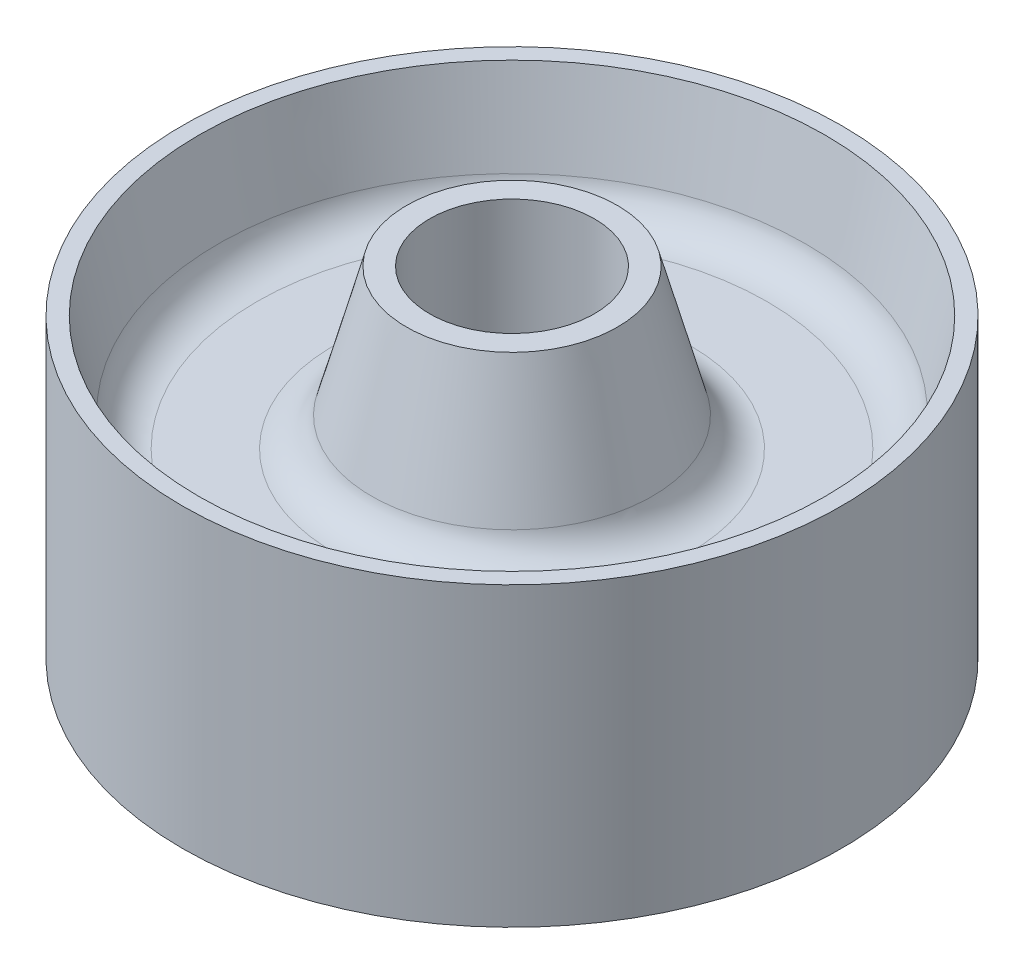
ISO-10303-21;
HEADER;
FILE_DESCRIPTION(('STEP AP214'),'2;1');
FILE_NAME('part.step','',(''),(''),'','','');
FILE_SCHEMA(('AUTOMOTIVE_DESIGN { 1 0 10303 214 1 1 1 1 }'));
ENDSEC;
DATA;
#1=APPLICATION_CONTEXT('core data for automotive mechanical design processes');
#2=APPLICATION_PROTOCOL_DEFINITION('international standard','automotive_design',2000,#1);
#3=PRODUCT_CONTEXT('',#1,'mechanical');
#4=PRODUCT('Part','Part','',(#3));
#5=PRODUCT_RELATED_PRODUCT_CATEGORY('part','',(#4));
#6=PRODUCT_DEFINITION_FORMATION('','',#4);
#7=PRODUCT_DEFINITION_CONTEXT('part definition',#1,'design');
#8=PRODUCT_DEFINITION('design','',#6,#7);
#9=PRODUCT_DEFINITION_SHAPE('','',#8);
#10=(LENGTH_UNIT() NAMED_UNIT(*) SI_UNIT(.MILLI.,.METRE.));
#11=(NAMED_UNIT(*) PLANE_ANGLE_UNIT() SI_UNIT($,.RADIAN.));
#12=(NAMED_UNIT(*) SI_UNIT($,.STERADIAN.) SOLID_ANGLE_UNIT());
#13=UNCERTAINTY_MEASURE_WITH_UNIT(LENGTH_MEASURE(1.E-05),#10,'distance_accuracy_value','');
#14=(GEOMETRIC_REPRESENTATION_CONTEXT(3) GLOBAL_UNCERTAINTY_ASSIGNED_CONTEXT((#13)) GLOBAL_UNIT_ASSIGNED_CONTEXT((#10,
#11,#12)) REPRESENTATION_CONTEXT('',''));
#15=CARTESIAN_POINT('',(0.,0.,0.));
#16=DIRECTION('',(0.,0.,1.));
#17=DIRECTION('',(1.,0.,0.));
#18=AXIS2_PLACEMENT_3D('',#15,#16,#17);
#19=CARTESIAN_POINT('',(0.,0.,0.));
#20=DIRECTION('',(0.,-1.,0.));
#21=DIRECTION('',(0.,0.,-1.));
#22=AXIS2_PLACEMENT_3D('',#19,#20,#21);
#23=CYLINDRICAL_SURFACE('',#22,12.5);
#24=CARTESIAN_POINT('',(0.,0.,0.));
#25=DIRECTION('',(0.,-1.,0.));
#26=DIRECTION('',(0.,0.,-1.));
#27=AXIS2_PLACEMENT_3D('',#24,#25,#26);
#28=CIRCLE('',#27,12.5);
#29=CARTESIAN_POINT('',(0.,0.,-12.5));
#30=VERTEX_POINT('',#29);
#31=EDGE_CURVE('E85',#30,#30,#28,.T.);
#32=ORIENTED_EDGE('',*,*,#31,.T.);
#33=EDGE_LOOP('',(#32));
#34=FACE_BOUND('',#33,.T.);
#35=CARTESIAN_POINT('',(0.,58.,0.));
#36=DIRECTION('',(0.,-1.,0.));
#37=DIRECTION('',(0.,0.,-1.));
#38=AXIS2_PLACEMENT_3D('',#35,#36,#37);
#39=CIRCLE('',#38,12.5);
#40=CARTESIAN_POINT('',(0.,58.,-12.5));
#41=VERTEX_POINT('',#40);
#42=EDGE_CURVE('E10',#41,#41,#39,.T.);
#43=ORIENTED_EDGE('',*,*,#42,.F.);
#44=EDGE_LOOP('',(#43));
#45=FACE_BOUND('',#44,.T.);
#46=ADVANCED_FACE('F33',(#34,#45),#23,.F.);
#47=CARTESIAN_POINT('',(16.,58.,0.));
#48=DIRECTION('',(0.,1.,0.));
#49=DIRECTION('',(0.,0.,1.));
#50=AXIS2_PLACEMENT_3D('',#47,#48,#49);
#51=PLANE('',#50);
#52=ORIENTED_EDGE('',*,*,#42,.T.);
#53=EDGE_LOOP('',(#52));
#54=FACE_BOUND('',#53,.T.);
#55=CARTESIAN_POINT('',(0.,58.,0.));
#56=DIRECTION('',(0.,-1.,0.));
#57=DIRECTION('',(0.,0.,-1.));
#58=AXIS2_PLACEMENT_3D('',#55,#56,#57);
#59=CIRCLE('',#58,16.);
#60=CARTESIAN_POINT('',(0.,58.,-16.));
#61=VERTEX_POINT('',#60);
#62=EDGE_CURVE('E39',#61,#61,#59,.T.);
#63=ORIENTED_EDGE('',*,*,#62,.F.);
#64=EDGE_LOOP('',(#63));
#65=FACE_BOUND('',#64,.T.);
#66=ADVANCED_FACE('F103',(#54,#65),#51,.T.);
#67=CARTESIAN_POINT('',(0.,38.4315071456301,0.));
#68=DIRECTION('',(0.,-1.,0.));
#69=DIRECTION('',(0.,0.,-1.));
#70=AXIS2_PLACEMENT_3D('',#67,#68,#69);
#71=CONICAL_SURFACE('',#70,21.2998001480585,0.264488382549233);
#72=ORIENTED_EDGE('',*,*,#62,.T.);
#73=EDGE_LOOP('',(#72));
#74=FACE_BOUND('',#73,.T.);
#75=CARTESIAN_POINT('',(0.,38.4315071456301,0.));
#76=DIRECTION('',(0.,-1.,0.));
#77=DIRECTION('',(0.,0.,-1.));
#78=AXIS2_PLACEMENT_3D('',#75,#76,#77);
#79=CIRCLE('',#78,21.2998001480585);
#80=CARTESIAN_POINT('',(0.,38.4315071456301,-21.2998001480585));
#81=VERTEX_POINT('',#80);
#82=EDGE_CURVE('E43',#81,#81,#79,.T.);
#83=ORIENTED_EDGE('',*,*,#82,.F.);
#84=EDGE_LOOP('',(#83));
#85=FACE_BOUND('',#84,.T.);
#86=ADVANCED_FACE('F107',(#74,#85),#71,.T.);
#87=CARTESIAN_POINT('',(0.,40.,0.));
#88=DIRECTION('',(0.,-1.,0.));
#89=DIRECTION('',(0.,0.,-1.));
#90=AXIS2_PLACEMENT_3D('',#87,#88,#89);
#91=TOROIDAL_SURFACE('',#90,27.0911583795782,6.);
#92=ORIENTED_EDGE('',*,*,#82,.T.);
#93=EDGE_LOOP('',(#92));
#94=FACE_BOUND('',#93,.T.);
#95=CARTESIAN_POINT('',(0.,34.,0.));
#96=DIRECTION('',(0.,-1.,0.));
#97=DIRECTION('',(0.,0.,-1.));
#98=AXIS2_PLACEMENT_3D('',#95,#96,#97);
#99=CIRCLE('',#98,27.0911583795782);
#100=CARTESIAN_POINT('',(0.,34.,-27.0911583795782));
#101=VERTEX_POINT('',#100);
#102=EDGE_CURVE('E47',#101,#101,#99,.T.);
#103=ORIENTED_EDGE('',*,*,#102,.F.);
#104=EDGE_LOOP('',(#103));
#105=FACE_BOUND('',#104,.T.);
#106=ADVANCED_FACE('F111',(#94,#105),#91,.F.);
#107=CARTESIAN_POINT('',(38.7166892327944,34.,0.));
#108=DIRECTION('',(0.,1.,0.));
#109=DIRECTION('',(0.,0.,1.));
#110=AXIS2_PLACEMENT_3D('',#107,#108,#109);
#111=PLANE('',#110);
#112=ORIENTED_EDGE('',*,*,#102,.T.);
#113=EDGE_LOOP('',(#112));
#114=FACE_BOUND('',#113,.T.);
#115=CARTESIAN_POINT('',(0.,34.,0.));
#116=DIRECTION('',(0.,-1.,0.));
#117=DIRECTION('',(0.,0.,-1.));
#118=AXIS2_PLACEMENT_3D('',#115,#116,#117);
#119=CIRCLE('',#118,38.7166892327944);
#120=CARTESIAN_POINT('',(0.,34.,-38.7166892327944));
#121=VERTEX_POINT('',#120);
#122=EDGE_CURVE('E52',#121,#121,#119,.T.);
#123=ORIENTED_EDGE('',*,*,#122,.F.);
#124=EDGE_LOOP('',(#123));
#125=FACE_BOUND('',#124,.T.);
#126=ADVANCED_FACE('F117',(#114,#125),#111,.T.);
#127=CARTESIAN_POINT('',(0.,40.,0.));
#128=DIRECTION('',(0.,-1.,0.));
#129=DIRECTION('',(0.,0.,-1.));
#130=AXIS2_PLACEMENT_3D('',#127,#128,#129);
#131=TOROIDAL_SURFACE('',#130,38.7166892327944,5.99999999999999);
#132=ORIENTED_EDGE('',*,*,#122,.T.);
#133=EDGE_LOOP('',(#132));
#134=FACE_BOUND('',#133,.T.);
#135=CARTESIAN_POINT('',(0.,38.6630511909871,0.));
#136=DIRECTION('',(0.,-1.,0.));
#137=DIRECTION('',(0.,0.,-1.));
#138=AXIS2_PLACEMENT_3D('',#135,#136,#137);
#139=CIRCLE('',#138,44.5658402722256);
#140=CARTESIAN_POINT('',(0.,38.6630511909871,-44.5658402722256));
#141=VERTEX_POINT('',#140);
#142=EDGE_CURVE('E55',#141,#141,#139,.T.);
#143=ORIENTED_EDGE('',*,*,#142,.F.);
#144=EDGE_LOOP('',(#143));
#145=FACE_BOUND('',#144,.T.);
#146=ADVANCED_FACE('F121',(#134,#145),#131,.F.);
#147=CARTESIAN_POINT('',(0.,51.5,0.));
#148=DIRECTION('',(0.,1.,0.));
#149=DIRECTION('',(0.,0.,1.));
#150=AXIS2_PLACEMENT_3D('',#147,#148,#149);
#151=CONICAL_SURFACE('',#150,47.5,0.224711168414643);
#152=ORIENTED_EDGE('',*,*,#142,.T.);
#153=EDGE_LOOP('',(#152));
#154=FACE_BOUND('',#153,.T.);
#155=CARTESIAN_POINT('',(0.,51.5,0.));
#156=DIRECTION('',(0.,-1.,0.));
#157=DIRECTION('',(0.,0.,-1.));
#158=AXIS2_PLACEMENT_3D('',#155,#156,#157);
#159=CIRCLE('',#158,47.5);
#160=CARTESIAN_POINT('',(0.,51.5,-47.5));
#161=VERTEX_POINT('',#160);
#162=EDGE_CURVE('E58',#161,#161,#159,.T.);
#163=ORIENTED_EDGE('',*,*,#162,.F.);
#164=EDGE_LOOP('',(#163));
#165=FACE_BOUND('',#164,.T.);
#166=ADVANCED_FACE('F125',(#154,#165),#151,.F.);
#167=CARTESIAN_POINT('',(50.,51.5,0.));
#168=DIRECTION('',(0.,1.,0.));
#169=DIRECTION('',(0.,0.,1.));
#170=AXIS2_PLACEMENT_3D('',#167,#168,#169);
#171=PLANE('',#170);
#172=ORIENTED_EDGE('',*,*,#162,.T.);
#173=EDGE_LOOP('',(#172));
#174=FACE_BOUND('',#173,.T.);
#175=CARTESIAN_POINT('',(0.,51.5,0.));
#176=DIRECTION('',(0.,-1.,0.));
#177=DIRECTION('',(0.,0.,-1.));
#178=AXIS2_PLACEMENT_3D('',#175,#176,#177);
#179=CIRCLE('',#178,50.);
#180=CARTESIAN_POINT('',(0.,51.5,-50.));
#181=VERTEX_POINT('',#180);
#182=EDGE_CURVE('E61',#181,#181,#179,.T.);
#183=ORIENTED_EDGE('',*,*,#182,.F.);
#184=EDGE_LOOP('',(#183));
#185=FACE_BOUND('',#184,.T.);
#186=ADVANCED_FACE('F129',(#174,#185),#171,.T.);
#187=CARTESIAN_POINT('',(0.,0.,0.));
#188=DIRECTION('',(0.,-1.,0.));
#189=DIRECTION('',(0.,0.,-1.));
#190=AXIS2_PLACEMENT_3D('',#187,#188,#189);
#191=CYLINDRICAL_SURFACE('',#190,50.);
#192=ORIENTED_EDGE('',*,*,#182,.T.);
#193=EDGE_LOOP('',(#192));
#194=FACE_BOUND('',#193,.T.);
#195=CARTESIAN_POINT('',(0.,6.5,0.));
#196=DIRECTION('',(0.,-1.,0.));
#197=DIRECTION('',(0.,0.,-1.));
#198=AXIS2_PLACEMENT_3D('',#195,#196,#197);
#199=CIRCLE('',#198,50.);
#200=CARTESIAN_POINT('',(0.,6.5,-50.));
#201=VERTEX_POINT('',#200);
#202=EDGE_CURVE('E64',#201,#201,#199,.T.);
#203=ORIENTED_EDGE('',*,*,#202,.F.);
#204=EDGE_LOOP('',(#203));
#205=FACE_BOUND('',#204,.T.);
#206=ADVANCED_FACE('F133',(#194,#205),#191,.T.);
#207=CARTESIAN_POINT('',(47.5,6.5,0.));
#208=DIRECTION('',(0.,-1.,0.));
#209=DIRECTION('',(0.,0.,-1.));
#210=AXIS2_PLACEMENT_3D('',#207,#208,#209);
#211=PLANE('',#210);
#212=ORIENTED_EDGE('',*,*,#202,.T.);
#213=EDGE_LOOP('',(#212));
#214=FACE_BOUND('',#213,.T.);
#215=CARTESIAN_POINT('',(0.,6.50000000000001,0.));
#216=DIRECTION('',(0.,-1.,0.));
#217=DIRECTION('',(0.,0.,-1.));
#218=AXIS2_PLACEMENT_3D('',#215,#216,#217);
#219=CIRCLE('',#218,47.5);
#220=CARTESIAN_POINT('',(0.,6.50000000000001,-47.5));
#221=VERTEX_POINT('',#220);
#222=EDGE_CURVE('E67',#221,#221,#219,.T.);
#223=ORIENTED_EDGE('',*,*,#222,.F.);
#224=EDGE_LOOP('',(#223));
#225=FACE_BOUND('',#224,.T.);
#226=ADVANCED_FACE('F137',(#214,#225),#211,.T.);
#227=CARTESIAN_POINT('',(0.,19.3369488090128,0.));
#228=DIRECTION('',(0.,-1.,0.));
#229=DIRECTION('',(0.,0.,-1.));
#230=AXIS2_PLACEMENT_3D('',#227,#228,#229);
#231=CONICAL_SURFACE('',#230,44.5658402722256,0.224711168414644);
#232=ORIENTED_EDGE('',*,*,#222,.T.);
#233=EDGE_LOOP('',(#232));
#234=FACE_BOUND('',#233,.T.);
#235=CARTESIAN_POINT('',(0.,19.3369488090128,0.));
#236=DIRECTION('',(0.,-1.,0.));
#237=DIRECTION('',(0.,0.,-1.));
#238=AXIS2_PLACEMENT_3D('',#235,#236,#237);
#239=CIRCLE('',#238,44.5658402722256);
#240=CARTESIAN_POINT('',(0.,19.3369488090128,-44.5658402722256));
#241=VERTEX_POINT('',#240);
#242=EDGE_CURVE('E70',#241,#241,#239,.T.);
#243=ORIENTED_EDGE('',*,*,#242,.F.);
#244=EDGE_LOOP('',(#243));
#245=FACE_BOUND('',#244,.T.);
#246=ADVANCED_FACE('F141',(#234,#245),#231,.F.);
#247=CARTESIAN_POINT('',(0.,18.,0.));
#248=DIRECTION('',(0.,-1.,0.));
#249=DIRECTION('',(0.,0.,-1.));
#250=AXIS2_PLACEMENT_3D('',#247,#248,#249);
#251=TOROIDAL_SURFACE('',#250,38.7166892327944,5.99999999999999);
#252=ORIENTED_EDGE('',*,*,#242,.T.);
#253=EDGE_LOOP('',(#252));
#254=FACE_BOUND('',#253,.T.);
#255=CARTESIAN_POINT('',(0.,24.,0.));
#256=DIRECTION('',(0.,-1.,0.));
#257=DIRECTION('',(0.,0.,-1.));
#258=AXIS2_PLACEMENT_3D('',#255,#256,#257);
#259=CIRCLE('',#258,38.7166892327944);
#260=CARTESIAN_POINT('',(0.,24.,-38.7166892327944));
#261=VERTEX_POINT('',#260);
#262=EDGE_CURVE('E73',#261,#261,#259,.T.);
#263=ORIENTED_EDGE('',*,*,#262,.F.);
#264=EDGE_LOOP('',(#263));
#265=FACE_BOUND('',#264,.T.);
#266=ADVANCED_FACE('F145',(#254,#265),#251,.F.);
#267=CARTESIAN_POINT('',(27.0911583795782,24.,0.));
#268=DIRECTION('',(0.,-1.,0.));
#269=DIRECTION('',(0.,0.,-1.));
#270=AXIS2_PLACEMENT_3D('',#267,#268,#269);
#271=PLANE('',#270);
#272=ORIENTED_EDGE('',*,*,#262,.T.);
#273=EDGE_LOOP('',(#272));
#274=FACE_BOUND('',#273,.T.);
#275=CARTESIAN_POINT('',(0.,24.,0.));
#276=DIRECTION('',(0.,-1.,0.));
#277=DIRECTION('',(0.,0.,-1.));
#278=AXIS2_PLACEMENT_3D('',#275,#276,#277);
#279=CIRCLE('',#278,27.0911583795782);
#280=CARTESIAN_POINT('',(0.,24.,-27.0911583795782));
#281=VERTEX_POINT('',#280);
#282=EDGE_CURVE('E76',#281,#281,#279,.T.);
#283=ORIENTED_EDGE('',*,*,#282,.F.);
#284=EDGE_LOOP('',(#283));
#285=FACE_BOUND('',#284,.T.);
#286=ADVANCED_FACE('F149',(#274,#285),#271,.T.);
#287=CARTESIAN_POINT('',(0.,18.,0.));
#288=DIRECTION('',(0.,-1.,0.));
#289=DIRECTION('',(0.,0.,-1.));
#290=AXIS2_PLACEMENT_3D('',#287,#288,#289);
#291=TOROIDAL_SURFACE('',#290,27.0911583795782,6.);
#292=ORIENTED_EDGE('',*,*,#282,.T.);
#293=EDGE_LOOP('',(#292));
#294=FACE_BOUND('',#293,.T.);
#295=CARTESIAN_POINT('',(0.,19.5684928543699,0.));
#296=DIRECTION('',(0.,-1.,0.));
#297=DIRECTION('',(0.,0.,-1.));
#298=AXIS2_PLACEMENT_3D('',#295,#296,#297);
#299=CIRCLE('',#298,21.2998001480585);
#300=CARTESIAN_POINT('',(0.,19.5684928543699,-21.2998001480585));
#301=VERTEX_POINT('',#300);
#302=EDGE_CURVE('E79',#301,#301,#299,.T.);
#303=ORIENTED_EDGE('',*,*,#302,.F.);
#304=EDGE_LOOP('',(#303));
#305=FACE_BOUND('',#304,.T.);
#306=ADVANCED_FACE('F99',(#294,#305),#291,.F.);
#307=CARTESIAN_POINT('',(0.,0.,0.));
#308=DIRECTION('',(0.,1.,0.));
#309=DIRECTION('',(0.,0.,1.));
#310=AXIS2_PLACEMENT_3D('',#307,#308,#309);
#311=CONICAL_SURFACE('',#310,16.,0.264488382549233);
#312=ORIENTED_EDGE('',*,*,#302,.T.);
#313=EDGE_LOOP('',(#312));
#314=FACE_BOUND('',#313,.T.);
#315=CARTESIAN_POINT('',(0.,0.,0.));
#316=DIRECTION('',(0.,-1.,0.));
#317=DIRECTION('',(0.,0.,-1.));
#318=AXIS2_PLACEMENT_3D('',#315,#316,#317);
#319=CIRCLE('',#318,16.);
#320=CARTESIAN_POINT('',(0.,0.,-16.));
#321=VERTEX_POINT('',#320);
#322=EDGE_CURVE('E82',#321,#321,#319,.T.);
#323=ORIENTED_EDGE('',*,*,#322,.F.);
#324=EDGE_LOOP('',(#323));
#325=FACE_BOUND('',#324,.T.);
#326=ADVANCED_FACE('F93',(#314,#325),#311,.T.);
#327=CARTESIAN_POINT('',(12.5,0.,0.));
#328=DIRECTION('',(0.,-1.,0.));
#329=DIRECTION('',(0.,0.,-1.));
#330=AXIS2_PLACEMENT_3D('',#327,#328,#329);
#331=PLANE('',#330);
#332=ORIENTED_EDGE('',*,*,#322,.T.);
#333=EDGE_LOOP('',(#332));
#334=FACE_BOUND('',#333,.T.);
#335=ORIENTED_EDGE('',*,*,#31,.F.);
#336=EDGE_LOOP('',(#335));
#337=FACE_BOUND('',#336,.T.);
#338=ADVANCED_FACE('F91',(#334,#337),#331,.T.);
#339=CLOSED_SHELL('',(#46,#66,#86,#106,#126,#146,#166,#186,#206,#226,#246,#266,#286,#306,#326,#338));
#340=MANIFOLD_SOLID_BREP('B2',#339);
#341=ADVANCED_BREP_SHAPE_REPRESENTATION('',(#18,#340),#14);
#342=SHAPE_DEFINITION_REPRESENTATION(#9,#341);
ENDSEC;
END-ISO-10303-21;
